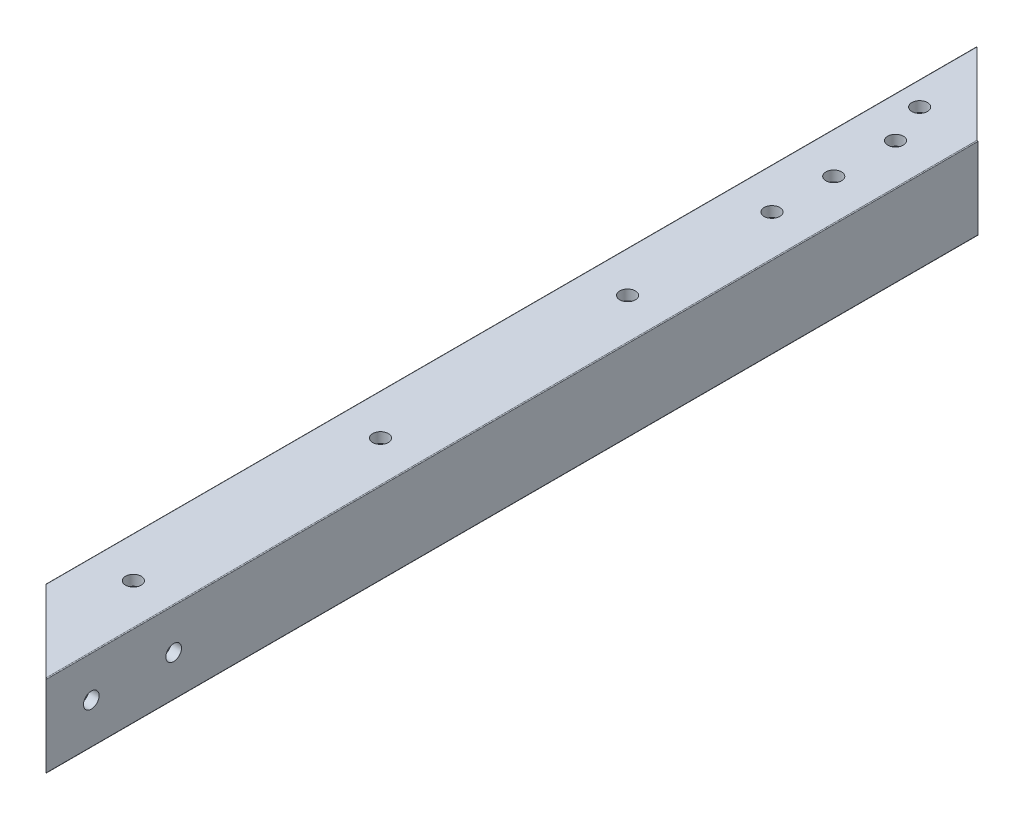
ISO-10303-21;
HEADER;
FILE_DESCRIPTION(('STEP AP214'),'2;1');
FILE_NAME('part.step','',(''),(''),'','','');
FILE_SCHEMA(('AUTOMOTIVE_DESIGN { 1 0 10303 214 1 1 1 1 }'));
ENDSEC;
DATA;
#1=APPLICATION_CONTEXT('core data for automotive mechanical design processes');
#2=APPLICATION_PROTOCOL_DEFINITION('international standard','automotive_design',2000,#1);
#3=PRODUCT_CONTEXT('',#1,'mechanical');
#4=PRODUCT('Part','Part','',(#3));
#5=PRODUCT_RELATED_PRODUCT_CATEGORY('part','',(#4));
#6=PRODUCT_DEFINITION_FORMATION('','',#4);
#7=PRODUCT_DEFINITION_CONTEXT('part definition',#1,'design');
#8=PRODUCT_DEFINITION('design','',#6,#7);
#9=PRODUCT_DEFINITION_SHAPE('','',#8);
#10=(LENGTH_UNIT() NAMED_UNIT(*) SI_UNIT(.MILLI.,.METRE.));
#11=(NAMED_UNIT(*) PLANE_ANGLE_UNIT() SI_UNIT($,.RADIAN.));
#12=(NAMED_UNIT(*) SI_UNIT($,.STERADIAN.) SOLID_ANGLE_UNIT());
#13=UNCERTAINTY_MEASURE_WITH_UNIT(LENGTH_MEASURE(1.E-05),#10,'distance_accuracy_value','');
#14=(GEOMETRIC_REPRESENTATION_CONTEXT(3) GLOBAL_UNCERTAINTY_ASSIGNED_CONTEXT((#13)) GLOBAL_UNIT_ASSIGNED_CONTEXT((#10,
#11,#12)) REPRESENTATION_CONTEXT('',''));
#15=CARTESIAN_POINT('',(0.,0.,0.));
#16=DIRECTION('',(0.,0.,1.));
#17=DIRECTION('',(1.,0.,0.));
#18=AXIS2_PLACEMENT_3D('',#15,#16,#17);
#19=CARTESIAN_POINT('',(3.175,4.7625,1828.8));
#20=DIRECTION('',(1.,0.,0.));
#21=DIRECTION('',(0.,1.,0.));
#22=AXIS2_PLACEMENT_3D('',#19,#20,#21);
#23=PLANE('',#22);
#24=DIRECTION('',(0.,1.,0.));
#25=VECTOR('',#24,1.);
#26=CARTESIAN_POINT('',(3.175,4.7625,1806.575));
#27=LINE('',#26,#25);
#28=CARTESIAN_POINT('',(3.175,4.7625,1806.575));
#29=VERTEX_POINT('',#28);
#30=CARTESIAN_POINT('',(3.175,20.6375,1806.575));
#31=VERTEX_POINT('',#30);
#32=EDGE_CURVE('E319',#29,#31,#27,.T.);
#33=ORIENTED_EDGE('',*,*,#32,.F.);
#34=DIRECTION('',(0.,0.,-1.));
#35=VECTOR('',#34,1.);
#36=CARTESIAN_POINT('',(3.175,4.7625,1828.8));
#37=LINE('',#36,#35);
#38=CARTESIAN_POINT('',(3.175,4.7625,1519.555));
#39=VERTEX_POINT('',#38);
#40=EDGE_CURVE('E67',#29,#39,#37,.T.);
#41=ORIENTED_EDGE('',*,*,#40,.T.);
#42=DIRECTION('',(0.,-1.,0.));
#43=VECTOR('',#42,1.);
#44=CARTESIAN_POINT('',(3.175,4.7625,1519.555));
#45=LINE('',#44,#43);
#46=CARTESIAN_POINT('',(3.175,20.6375,1519.555));
#47=VERTEX_POINT('',#46);
#48=EDGE_CURVE('E265',#47,#39,#45,.T.);
#49=ORIENTED_EDGE('',*,*,#48,.F.);
#50=DIRECTION('',(0.,0.,-1.));
#51=VECTOR('',#50,1.);
#52=CARTESIAN_POINT('',(3.175,20.6375,1828.8));
#53=LINE('',#52,#51);
#54=EDGE_CURVE('E52',#31,#47,#53,.T.);
#55=ORIENTED_EDGE('',*,*,#54,.F.);
#56=EDGE_LOOP('',(#33,#41,#49,#55));
#57=FACE_BOUND('',#56,.T.);
#58=ADVANCED_FACE('F44',(#57),#23,.T.);
#59=CARTESIAN_POINT('',(4.7625,20.6375,1828.8));
#60=DIRECTION('',(0.,0.,-1.));
#61=DIRECTION('',(-1.,0.,0.));
#62=AXIS2_PLACEMENT_3D('',#59,#60,#61);
#63=CYLINDRICAL_SURFACE('',#62,1.5875);
#64=DIRECTION('',(0.,0.,-1.));
#65=VECTOR('',#64,1.);
#66=CARTESIAN_POINT('',(4.7625,22.225,1828.8));
#67=LINE('',#66,#65);
#68=CARTESIAN_POINT('',(4.7625,22.225,1808.1625));
#69=VERTEX_POINT('',#68);
#70=CARTESIAN_POINT('',(4.7625,22.225,1521.1425));
#71=VERTEX_POINT('',#70);
#72=EDGE_CURVE('E222',#69,#71,#67,.T.);
#73=ORIENTED_EDGE('',*,*,#72,.F.);
#74=CARTESIAN_POINT('',(4.7625,20.6375,1808.1625));
#75=DIRECTION('',(0.707106781186545,0.,-0.70710678118655));
#76=DIRECTION('',(-0.70710678118655,0.,-0.707106781186545));
#77=AXIS2_PLACEMENT_3D('',#74,#75,#76);
#78=ELLIPSE('',#77,2.24506403026728,1.5875);
#79=EDGE_CURVE('E312',#69,#31,#78,.F.);
#80=ORIENTED_EDGE('',*,*,#79,.T.);
#81=ORIENTED_EDGE('',*,*,#54,.T.);
#82=CARTESIAN_POINT('',(4.7625,20.6375,1521.1425));
#83=DIRECTION('',(-0.707106781186544,0.,0.707106781186551));
#84=DIRECTION('',(-0.707106781186551,0.,-0.707106781186544));
#85=AXIS2_PLACEMENT_3D('',#82,#83,#84);
#86=ELLIPSE('',#85,2.24506403026728,1.5875);
#87=EDGE_CURVE('E258',#47,#71,#86,.F.);
#88=ORIENTED_EDGE('',*,*,#87,.T.);
#89=EDGE_LOOP('',(#73,#80,#81,#88));
#90=FACE_BOUND('',#89,.T.);
#91=ADVANCED_FACE('F263',(#90),#63,.F.);
#92=CARTESIAN_POINT('',(4.7625,22.225,1828.8));
#93=DIRECTION('',(0.,-1.,0.));
#94=DIRECTION('',(0.,0.,-1.));
#95=AXIS2_PLACEMENT_3D('',#92,#93,#94);
#96=PLANE('',#95);
#97=CARTESIAN_POINT('',(7.43948775786736,22.225,1541.43180412579));
#98=DIRECTION('',(0.,-1.,0.));
#99=DIRECTION('',(0.,0.,-1.));
#100=AXIS2_PLACEMENT_3D('',#97,#98,#99);
#101=CIRCLE('',#100,2.41299999999992);
#102=CARTESIAN_POINT('',(7.43948775786736,22.225,1539.01880412579));
#103=VERTEX_POINT('',#102);
#104=EDGE_CURVE('E512',#103,#103,#101,.T.);
#105=ORIENTED_EDGE('',*,*,#104,.F.);
#106=EDGE_LOOP('',(#105));
#107=FACE_BOUND('',#106,.T.);
#108=CARTESIAN_POINT('',(12.7000000000056,22.225,1554.13180412579));
#109=DIRECTION('',(0.,-1.,0.));
#110=DIRECTION('',(0.,0.,-1.));
#111=AXIS2_PLACEMENT_3D('',#108,#109,#110);
#112=CIRCLE('',#111,2.41300000000005);
#113=CARTESIAN_POINT('',(12.7000000000056,22.225,1551.71880412579));
#114=VERTEX_POINT('',#113);
#115=EDGE_CURVE('E506',#114,#114,#112,.T.);
#116=ORIENTED_EDGE('',*,*,#115,.F.);
#117=EDGE_LOOP('',(#116));
#118=FACE_BOUND('',#117,.T.);
#119=CARTESIAN_POINT('',(12.7000000000055,22.225,1573.18180412579));
#120=DIRECTION('',(0.,-1.,0.));
#121=DIRECTION('',(0.,0.,-1.));
#122=AXIS2_PLACEMENT_3D('',#119,#120,#121);
#123=CIRCLE('',#122,2.413);
#124=CARTESIAN_POINT('',(12.7000000000055,22.225,1570.76880412579));
#125=VERTEX_POINT('',#124);
#126=EDGE_CURVE('E500',#125,#125,#123,.T.);
#127=ORIENTED_EDGE('',*,*,#126,.F.);
#128=EDGE_LOOP('',(#127));
#129=FACE_BOUND('',#128,.T.);
#130=CARTESIAN_POINT('',(12.7000000000054,22.225,1592.23180412579));
#131=DIRECTION('',(0.,-1.,0.));
#132=DIRECTION('',(0.,0.,-1.));
#133=AXIS2_PLACEMENT_3D('',#130,#131,#132);
#134=CIRCLE('',#133,2.41300000000008);
#135=CARTESIAN_POINT('',(12.7000000000054,22.225,1589.81880412579));
#136=VERTEX_POINT('',#135);
#137=EDGE_CURVE('E494',#136,#136,#134,.T.);
#138=ORIENTED_EDGE('',*,*,#137,.F.);
#139=EDGE_LOOP('',(#138));
#140=FACE_BOUND('',#139,.T.);
#141=CARTESIAN_POINT('',(12.7,22.225,1789.15923163679));
#142=DIRECTION('',(0.,-1.,0.));
#143=DIRECTION('',(0.,0.,-1.));
#144=AXIS2_PLACEMENT_3D('',#141,#142,#143);
#145=CIRCLE('',#144,2.413);
#146=CARTESIAN_POINT('',(12.7,22.225,1786.74623163679));
#147=VERTEX_POINT('',#146);
#148=EDGE_CURVE('E548',#147,#147,#145,.T.);
#149=ORIENTED_EDGE('',*,*,#148,.F.);
#150=EDGE_LOOP('',(#149));
#151=FACE_BOUND('',#150,.T.);
#152=CARTESIAN_POINT('',(12.7,22.225,1712.95923163679));
#153=DIRECTION('',(0.,-1.,0.));
#154=DIRECTION('',(0.,0.,-1.));
#155=AXIS2_PLACEMENT_3D('',#152,#153,#154);
#156=CIRCLE('',#155,2.413);
#157=CARTESIAN_POINT('',(12.7,22.225,1710.54623163679));
#158=VERTEX_POINT('',#157);
#159=EDGE_CURVE('E542',#158,#158,#156,.T.);
#160=ORIENTED_EDGE('',*,*,#159,.F.);
#161=EDGE_LOOP('',(#160));
#162=FACE_BOUND('',#161,.T.);
#163=CARTESIAN_POINT('',(12.7,22.225,1636.75923163679));
#164=DIRECTION('',(0.,-1.,0.));
#165=DIRECTION('',(0.,0.,-1.));
#166=AXIS2_PLACEMENT_3D('',#163,#164,#165);
#167=CIRCLE('',#166,2.413);
#168=CARTESIAN_POINT('',(12.7,22.225,1634.34623163679));
#169=VERTEX_POINT('',#168);
#170=EDGE_CURVE('E536',#169,#169,#167,.T.);
#171=ORIENTED_EDGE('',*,*,#170,.F.);
#172=EDGE_LOOP('',(#171));
#173=FACE_BOUND('',#172,.T.);
#174=DIRECTION('',(0.70710678118655,0.,0.707106781186545));
#175=VECTOR('',#174,1.);
#176=CARTESIAN_POINT('',(15.08125,22.225,1818.48125));
#177=LINE('',#176,#175);
#178=CARTESIAN_POINT('',(20.6375,22.225,1824.0375));
#179=VERTEX_POINT('',#178);
#180=EDGE_CURVE('E249',#69,#179,#177,.T.);
#181=ORIENTED_EDGE('',*,*,#180,.F.);
#182=ORIENTED_EDGE('',*,*,#72,.T.);
#183=DIRECTION('',(-0.707106781186551,0.,-0.707106781186544));
#184=VECTOR('',#183,1.);
#185=CARTESIAN_POINT('',(158.59125,22.225,1674.97125));
#186=LINE('',#185,#184);
#187=CARTESIAN_POINT('',(20.6375,22.225,1537.0175));
#188=VERTEX_POINT('',#187);
#189=EDGE_CURVE('E248',#188,#71,#186,.T.);
#190=ORIENTED_EDGE('',*,*,#189,.F.);
#191=DIRECTION('',(0.,0.,-1.));
#192=VECTOR('',#191,1.);
#193=CARTESIAN_POINT('',(20.6375,22.225,1828.8));
#194=LINE('',#193,#192);
#195=EDGE_CURVE('E239',#179,#188,#194,.T.);
#196=ORIENTED_EDGE('',*,*,#195,.F.);
#197=EDGE_LOOP('',(#181,#182,#190,#196));
#198=FACE_BOUND('',#197,.T.);
#199=ADVANCED_FACE('F246',(#107,#118,#129,#140,#151,#162,#173,#198),#96,.T.);
#200=CARTESIAN_POINT('',(20.6375,20.6375,1828.8));
#201=DIRECTION('',(0.,0.,-1.));
#202=DIRECTION('',(-1.,0.,0.));
#203=AXIS2_PLACEMENT_3D('',#200,#201,#202);
#204=CYLINDRICAL_SURFACE('',#203,1.5875);
#205=DIRECTION('',(0.,0.,-1.));
#206=VECTOR('',#205,1.);
#207=CARTESIAN_POINT('',(22.225,20.6375,1828.8));
#208=LINE('',#207,#206);
#209=CARTESIAN_POINT('',(22.225,20.6375,1825.625));
#210=VERTEX_POINT('',#209);
#211=CARTESIAN_POINT('',(22.225,20.6375,1538.605));
#212=VERTEX_POINT('',#211);
#213=EDGE_CURVE('E197',#210,#212,#208,.T.);
#214=ORIENTED_EDGE('',*,*,#213,.F.);
#215=CARTESIAN_POINT('',(20.6375,20.6375,1824.0375));
#216=DIRECTION('',(0.707106781186545,0.,-0.70710678118655));
#217=DIRECTION('',(-0.70710678118655,0.,-0.707106781186545));
#218=AXIS2_PLACEMENT_3D('',#215,#216,#217);
#219=ELLIPSE('',#218,2.24506403026728,1.5875);
#220=EDGE_CURVE('E308',#210,#179,#219,.F.);
#221=ORIENTED_EDGE('',*,*,#220,.T.);
#222=ORIENTED_EDGE('',*,*,#195,.T.);
#223=CARTESIAN_POINT('',(20.6375,20.6375,1537.0175));
#224=DIRECTION('',(-0.707106781186544,0.,0.707106781186551));
#225=DIRECTION('',(-0.707106781186551,0.,-0.707106781186544));
#226=AXIS2_PLACEMENT_3D('',#223,#224,#225);
#227=ELLIPSE('',#226,2.24506403026728,1.5875);
#228=EDGE_CURVE('E261',#188,#212,#227,.F.);
#229=ORIENTED_EDGE('',*,*,#228,.T.);
#230=EDGE_LOOP('',(#214,#221,#222,#229));
#231=FACE_BOUND('',#230,.T.);
#232=ADVANCED_FACE('F306',(#231),#204,.F.);
#233=CARTESIAN_POINT('',(22.225,4.7625,1828.8));
#234=DIRECTION('',(-1.,0.,0.));
#235=DIRECTION('',(0.,0.,1.));
#236=AXIS2_PLACEMENT_3D('',#233,#234,#235);
#237=PLANE('',#236);
#238=CARTESIAN_POINT('',(22.225,12.7,1814.83));
#239=DIRECTION('',(-1.,0.,0.));
#240=DIRECTION('',(0.,0.,1.));
#241=AXIS2_PLACEMENT_3D('',#238,#239,#240);
#242=CIRCLE('',#241,2.4130000000001);
#243=CARTESIAN_POINT('',(22.225,12.7,1817.243));
#244=VERTEX_POINT('',#243);
#245=EDGE_CURVE('E454',#244,#244,#242,.F.);
#246=ORIENTED_EDGE('',*,*,#245,.T.);
#247=EDGE_LOOP('',(#246));
#248=FACE_BOUND('',#247,.T.);
#249=CARTESIAN_POINT('',(22.225,12.7,1789.43));
#250=DIRECTION('',(-1.,0.,0.));
#251=DIRECTION('',(0.,0.,1.));
#252=AXIS2_PLACEMENT_3D('',#249,#250,#251);
#253=CIRCLE('',#252,2.4130000000001);
#254=CARTESIAN_POINT('',(22.225,12.7,1791.843));
#255=VERTEX_POINT('',#254);
#256=EDGE_CURVE('E466',#255,#255,#253,.F.);
#257=ORIENTED_EDGE('',*,*,#256,.T.);
#258=EDGE_LOOP('',(#257));
#259=FACE_BOUND('',#258,.T.);
#260=DIRECTION('',(0.,-1.,0.));
#261=VECTOR('',#260,1.);
#262=CARTESIAN_POINT('',(22.225,4.7625,1825.625));
#263=LINE('',#262,#261);
#264=CARTESIAN_POINT('',(22.225,4.7625,1825.625));
#265=VERTEX_POINT('',#264);
#266=EDGE_CURVE('E310',#210,#265,#263,.T.);
#267=ORIENTED_EDGE('',*,*,#266,.F.);
#268=ORIENTED_EDGE('',*,*,#213,.T.);
#269=DIRECTION('',(0.,1.,0.));
#270=VECTOR('',#269,1.);
#271=CARTESIAN_POINT('',(22.225,4.7625,1538.605));
#272=LINE('',#271,#270);
#273=CARTESIAN_POINT('',(22.225,4.7625,1538.605));
#274=VERTEX_POINT('',#273);
#275=EDGE_CURVE('E303',#274,#212,#272,.T.);
#276=ORIENTED_EDGE('',*,*,#275,.F.);
#277=DIRECTION('',(0.,0.,-1.));
#278=VECTOR('',#277,1.);
#279=CARTESIAN_POINT('',(22.225,4.7625,1828.8));
#280=LINE('',#279,#278);
#281=EDGE_CURVE('E206',#265,#274,#280,.T.);
#282=ORIENTED_EDGE('',*,*,#281,.F.);
#283=EDGE_LOOP('',(#267,#268,#276,#282));
#284=FACE_BOUND('',#283,.T.);
#285=ADVANCED_FACE('F354',(#248,#259,#284),#237,.T.);
#286=CARTESIAN_POINT('',(20.6375,4.7625,1828.8));
#287=DIRECTION('',(0.,0.,-1.));
#288=DIRECTION('',(-1.,0.,0.));
#289=AXIS2_PLACEMENT_3D('',#286,#287,#288);
#290=CYLINDRICAL_SURFACE('',#289,1.5875);
#291=DIRECTION('',(0.,0.,-1.));
#292=VECTOR('',#291,1.);
#293=CARTESIAN_POINT('',(20.6375,3.175,1828.8));
#294=LINE('',#293,#292);
#295=CARTESIAN_POINT('',(20.6375,3.175,1824.0375));
#296=VERTEX_POINT('',#295);
#297=CARTESIAN_POINT('',(20.6375,3.175,1537.0175));
#298=VERTEX_POINT('',#297);
#299=EDGE_CURVE('E205',#296,#298,#294,.T.);
#300=ORIENTED_EDGE('',*,*,#299,.F.);
#301=CARTESIAN_POINT('',(20.6375,4.7625,1824.0375));
#302=DIRECTION('',(0.707106781186545,0.,-0.70710678118655));
#303=DIRECTION('',(-0.70710678118655,0.,-0.707106781186545));
#304=AXIS2_PLACEMENT_3D('',#301,#302,#303);
#305=ELLIPSE('',#304,2.24506403026728,1.5875);
#306=EDGE_CURVE('E314',#296,#265,#305,.F.);
#307=ORIENTED_EDGE('',*,*,#306,.T.);
#308=ORIENTED_EDGE('',*,*,#281,.T.);
#309=CARTESIAN_POINT('',(20.6375,4.7625,1537.0175));
#310=DIRECTION('',(-0.707106781186544,0.,0.707106781186551));
#311=DIRECTION('',(-0.707106781186551,0.,-0.707106781186544));
#312=AXIS2_PLACEMENT_3D('',#309,#310,#311);
#313=ELLIPSE('',#312,2.24506403026728,1.5875);
#314=EDGE_CURVE('E300',#274,#298,#313,.F.);
#315=ORIENTED_EDGE('',*,*,#314,.T.);
#316=EDGE_LOOP('',(#300,#307,#308,#315));
#317=FACE_BOUND('',#316,.T.);
#318=ADVANCED_FACE('F350',(#317),#290,.F.);
#319=CARTESIAN_POINT('',(4.7625,3.175,1828.8));
#320=DIRECTION('',(0.,1.,0.));
#321=DIRECTION('',(1.,0.,0.));
#322=AXIS2_PLACEMENT_3D('',#319,#320,#321);
#323=PLANE('',#322);
#324=CARTESIAN_POINT('',(7.43948775786736,3.175,1541.43180412579));
#325=DIRECTION('',(0.,1.,0.));
#326=DIRECTION('',(0.,0.,1.));
#327=AXIS2_PLACEMENT_3D('',#324,#325,#326);
#328=CIRCLE('',#327,2.41299999999992);
#329=CARTESIAN_POINT('',(7.43948775786736,3.175,1543.84480412579));
#330=VERTEX_POINT('',#329);
#331=EDGE_CURVE('E509',#330,#330,#328,.T.);
#332=ORIENTED_EDGE('',*,*,#331,.F.);
#333=EDGE_LOOP('',(#332));
#334=FACE_BOUND('',#333,.T.);
#335=CARTESIAN_POINT('',(12.7000000000056,3.175,1554.13180412579));
#336=DIRECTION('',(0.,1.,0.));
#337=DIRECTION('',(0.,0.,1.));
#338=AXIS2_PLACEMENT_3D('',#335,#336,#337);
#339=CIRCLE('',#338,2.41300000000005);
#340=CARTESIAN_POINT('',(12.7000000000056,3.175,1556.54480412579));
#341=VERTEX_POINT('',#340);
#342=EDGE_CURVE('E503',#341,#341,#339,.T.);
#343=ORIENTED_EDGE('',*,*,#342,.F.);
#344=EDGE_LOOP('',(#343));
#345=FACE_BOUND('',#344,.T.);
#346=CARTESIAN_POINT('',(12.7000000000055,3.175,1573.18180412579));
#347=DIRECTION('',(0.,1.,0.));
#348=DIRECTION('',(0.,0.,1.));
#349=AXIS2_PLACEMENT_3D('',#346,#347,#348);
#350=CIRCLE('',#349,2.413);
#351=CARTESIAN_POINT('',(12.7000000000055,3.175,1575.59480412579));
#352=VERTEX_POINT('',#351);
#353=EDGE_CURVE('E497',#352,#352,#350,.T.);
#354=ORIENTED_EDGE('',*,*,#353,.F.);
#355=EDGE_LOOP('',(#354));
#356=FACE_BOUND('',#355,.T.);
#357=CARTESIAN_POINT('',(12.7000000000054,3.175,1592.23180412579));
#358=DIRECTION('',(0.,1.,0.));
#359=DIRECTION('',(0.,0.,1.));
#360=AXIS2_PLACEMENT_3D('',#357,#358,#359);
#361=CIRCLE('',#360,2.41300000000008);
#362=CARTESIAN_POINT('',(12.7000000000054,3.175,1594.64480412579));
#363=VERTEX_POINT('',#362);
#364=EDGE_CURVE('E474',#363,#363,#361,.T.);
#365=ORIENTED_EDGE('',*,*,#364,.F.);
#366=EDGE_LOOP('',(#365));
#367=FACE_BOUND('',#366,.T.);
#368=CARTESIAN_POINT('',(12.7,3.175,1789.15923163679));
#369=DIRECTION('',(0.,1.,0.));
#370=DIRECTION('',(0.,0.,1.));
#371=AXIS2_PLACEMENT_3D('',#368,#369,#370);
#372=CIRCLE('',#371,2.413);
#373=CARTESIAN_POINT('',(12.7,3.175,1791.57223163679));
#374=VERTEX_POINT('',#373);
#375=EDGE_CURVE('E545',#374,#374,#372,.T.);
#376=ORIENTED_EDGE('',*,*,#375,.F.);
#377=EDGE_LOOP('',(#376));
#378=FACE_BOUND('',#377,.T.);
#379=CARTESIAN_POINT('',(12.7,3.175,1712.95923163679));
#380=DIRECTION('',(0.,1.,0.));
#381=DIRECTION('',(0.,0.,1.));
#382=AXIS2_PLACEMENT_3D('',#379,#380,#381);
#383=CIRCLE('',#382,2.413);
#384=CARTESIAN_POINT('',(12.7,3.175,1715.37223163679));
#385=VERTEX_POINT('',#384);
#386=EDGE_CURVE('E539',#385,#385,#383,.T.);
#387=ORIENTED_EDGE('',*,*,#386,.F.);
#388=EDGE_LOOP('',(#387));
#389=FACE_BOUND('',#388,.T.);
#390=CARTESIAN_POINT('',(12.7,3.175,1636.75923163679));
#391=DIRECTION('',(0.,1.,0.));
#392=DIRECTION('',(0.,0.,1.));
#393=AXIS2_PLACEMENT_3D('',#390,#391,#392);
#394=CIRCLE('',#393,2.413);
#395=CARTESIAN_POINT('',(12.7,3.175,1639.17223163679));
#396=VERTEX_POINT('',#395);
#397=EDGE_CURVE('E519',#396,#396,#394,.T.);
#398=ORIENTED_EDGE('',*,*,#397,.F.);
#399=EDGE_LOOP('',(#398));
#400=FACE_BOUND('',#399,.T.);
#401=DIRECTION('',(-0.70710678118655,0.,-0.707106781186545));
#402=VECTOR('',#401,1.);
#403=CARTESIAN_POINT('',(15.08125,3.175,1818.48125));
#404=LINE('',#403,#402);
#405=CARTESIAN_POINT('',(4.7625,3.175,1808.1625));
#406=VERTEX_POINT('',#405);
#407=EDGE_CURVE('E59',#296,#406,#404,.T.);
#408=ORIENTED_EDGE('',*,*,#407,.F.);
#409=ORIENTED_EDGE('',*,*,#299,.T.);
#410=DIRECTION('',(0.707106781186551,0.,0.707106781186544));
#411=VECTOR('',#410,1.);
#412=CARTESIAN_POINT('',(158.59125,3.175,1674.97125));
#413=LINE('',#412,#411);
#414=CARTESIAN_POINT('',(4.7625,3.175,1521.1425));
#415=VERTEX_POINT('',#414);
#416=EDGE_CURVE('E298',#415,#298,#413,.T.);
#417=ORIENTED_EDGE('',*,*,#416,.F.);
#418=DIRECTION('',(0.,0.,-1.));
#419=VECTOR('',#418,1.);
#420=CARTESIAN_POINT('',(4.7625,3.175,1828.8));
#421=LINE('',#420,#419);
#422=EDGE_CURVE('E207',#406,#415,#421,.T.);
#423=ORIENTED_EDGE('',*,*,#422,.F.);
#424=EDGE_LOOP('',(#408,#409,#417,#423));
#425=FACE_BOUND('',#424,.T.);
#426=ADVANCED_FACE('F355',(#334,#345,#356,#367,#378,#389,#400,#425),#323,.T.);
#427=CARTESIAN_POINT('',(4.7625,4.7625,1828.8));
#428=DIRECTION('',(0.,0.,-1.));
#429=DIRECTION('',(-1.,0.,0.));
#430=AXIS2_PLACEMENT_3D('',#427,#428,#429);
#431=CYLINDRICAL_SURFACE('',#430,1.5875);
#432=ORIENTED_EDGE('',*,*,#40,.F.);
#433=CARTESIAN_POINT('',(4.7625,4.7625,1808.1625));
#434=DIRECTION('',(0.707106781186545,0.,-0.70710678118655));
#435=DIRECTION('',(-0.70710678118655,0.,-0.707106781186545));
#436=AXIS2_PLACEMENT_3D('',#433,#434,#435);
#437=ELLIPSE('',#436,2.24506403026728,1.5875);
#438=EDGE_CURVE('E345',#29,#406,#437,.F.);
#439=ORIENTED_EDGE('',*,*,#438,.T.);
#440=ORIENTED_EDGE('',*,*,#422,.T.);
#441=CARTESIAN_POINT('',(4.7625,4.7625,1521.1425));
#442=DIRECTION('',(-0.707106781186544,0.,0.707106781186551));
#443=DIRECTION('',(-0.707106781186551,0.,-0.707106781186544));
#444=AXIS2_PLACEMENT_3D('',#441,#442,#443);
#445=ELLIPSE('',#444,2.24506403026728,1.5875);
#446=EDGE_CURVE('E296',#415,#39,#445,.F.);
#447=ORIENTED_EDGE('',*,*,#446,.T.);
#448=EDGE_LOOP('',(#432,#439,#440,#447));
#449=FACE_BOUND('',#448,.T.);
#450=ADVANCED_FACE('F357',(#449),#431,.F.);
#451=CARTESIAN_POINT('',(0.,0.254,1828.8));
#452=DIRECTION('',(1.,0.,0.));
#453=DIRECTION('',(0.,1.,0.));
#454=AXIS2_PLACEMENT_3D('',#451,#452,#453);
#455=PLANE('',#454);
#456=DIRECTION('',(0.,0.,-1.));
#457=VECTOR('',#456,1.);
#458=CARTESIAN_POINT('',(0.,0.254,1828.8));
#459=LINE('',#458,#457);
#460=CARTESIAN_POINT('',(0.,0.254,1803.4));
#461=VERTEX_POINT('',#460);
#462=CARTESIAN_POINT('',(0.,0.254,1516.38));
#463=VERTEX_POINT('',#462);
#464=EDGE_CURVE('E189',#461,#463,#459,.T.);
#465=ORIENTED_EDGE('',*,*,#464,.F.);
#466=DIRECTION('',(0.,1.,0.));
#467=VECTOR('',#466,1.);
#468=CARTESIAN_POINT('',(0.,0.254,1803.4));
#469=LINE('',#468,#467);
#470=CARTESIAN_POINT('',(0.,25.146,1803.4));
#471=VERTEX_POINT('',#470);
#472=EDGE_CURVE('E170',#461,#471,#469,.T.);
#473=ORIENTED_EDGE('',*,*,#472,.T.);
#474=DIRECTION('',(0.,0.,-1.));
#475=VECTOR('',#474,1.);
#476=CARTESIAN_POINT('',(0.,25.146,1828.8));
#477=LINE('',#476,#475);
#478=CARTESIAN_POINT('',(0.,25.1460000000001,1516.38));
#479=VERTEX_POINT('',#478);
#480=EDGE_CURVE('E204',#471,#479,#477,.T.);
#481=ORIENTED_EDGE('',*,*,#480,.T.);
#482=DIRECTION('',(0.,-1.,0.));
#483=VECTOR('',#482,1.);
#484=CARTESIAN_POINT('',(0.,0.254,1516.38));
#485=LINE('',#484,#483);
#486=EDGE_CURVE('E194',#479,#463,#485,.T.);
#487=ORIENTED_EDGE('',*,*,#486,.T.);
#488=EDGE_LOOP('',(#465,#473,#481,#487));
#489=FACE_BOUND('',#488,.T.);
#490=ADVANCED_FACE('F276',(#489),#455,.F.);
#491=CARTESIAN_POINT('',(0.254,25.146,1828.8));
#492=DIRECTION('',(0.,0.,-1.));
#493=DIRECTION('',(-1.,0.,0.));
#494=AXIS2_PLACEMENT_3D('',#491,#492,#493);
#495=CYLINDRICAL_SURFACE('',#494,0.254);
#496=CARTESIAN_POINT('',(0.254,25.146,1803.654));
#497=DIRECTION('',(0.707106781186545,0.,-0.70710678118655));
#498=DIRECTION('',(-0.70710678118655,0.,-0.707106781186545));
#499=AXIS2_PLACEMENT_3D('',#496,#497,#498);
#500=ELLIPSE('',#499,0.359210244842765,0.254);
#501=CARTESIAN_POINT('',(0.253999999999983,25.4,1803.654));
#502=VERTEX_POINT('',#501);
#503=EDGE_CURVE('E342',#502,#471,#500,.F.);
#504=ORIENTED_EDGE('',*,*,#503,.F.);
#505=DIRECTION('',(0.,0.,-1.));
#506=VECTOR('',#505,1.);
#507=CARTESIAN_POINT('',(0.254,25.4,1828.8));
#508=LINE('',#507,#506);
#509=CARTESIAN_POINT('',(0.25399999999999,25.4,1516.634));
#510=VERTEX_POINT('',#509);
#511=EDGE_CURVE('E201',#502,#510,#508,.T.);
#512=ORIENTED_EDGE('',*,*,#511,.T.);
#513=CARTESIAN_POINT('',(0.254,25.146,1516.634));
#514=DIRECTION('',(-0.707106781186544,0.,0.707106781186551));
#515=DIRECTION('',(-0.707106781186551,0.,-0.707106781186544));
#516=AXIS2_PLACEMENT_3D('',#513,#514,#515);
#517=ELLIPSE('',#516,0.359210244842764,0.254);
#518=EDGE_CURVE('E281',#479,#510,#517,.F.);
#519=ORIENTED_EDGE('',*,*,#518,.F.);
#520=ORIENTED_EDGE('',*,*,#480,.F.);
#521=EDGE_LOOP('',(#504,#512,#519,#520));
#522=FACE_BOUND('',#521,.T.);
#523=ADVANCED_FACE('F285',(#522),#495,.T.);
#524=CARTESIAN_POINT('',(0.254,25.4,1828.8));
#525=DIRECTION('',(0.,-1.,0.));
#526=DIRECTION('',(0.,0.,-1.));
#527=AXIS2_PLACEMENT_3D('',#524,#525,#526);
#528=PLANE('',#527);
#529=CARTESIAN_POINT('',(7.43948775786736,25.4,1541.43180412579));
#530=DIRECTION('',(0.,-1.,0.));
#531=DIRECTION('',(0.,0.,-1.));
#532=AXIS2_PLACEMENT_3D('',#529,#530,#531);
#533=CIRCLE('',#532,2.41299999999992);
#534=CARTESIAN_POINT('',(7.43948775786736,25.4,1539.01880412579));
#535=VERTEX_POINT('',#534);
#536=EDGE_CURVE('E471',#535,#535,#533,.T.);
#537=ORIENTED_EDGE('',*,*,#536,.T.);
#538=EDGE_LOOP('',(#537));
#539=FACE_BOUND('',#538,.T.);
#540=CARTESIAN_POINT('',(12.7000000000056,25.4,1554.13180412579));
#541=DIRECTION('',(0.,-1.,0.));
#542=DIRECTION('',(0.,0.,-1.));
#543=AXIS2_PLACEMENT_3D('',#540,#541,#542);
#544=CIRCLE('',#543,2.41300000000005);
#545=CARTESIAN_POINT('',(12.7000000000056,25.4,1551.71880412579));
#546=VERTEX_POINT('',#545);
#547=EDGE_CURVE('E478',#546,#546,#544,.T.);
#548=ORIENTED_EDGE('',*,*,#547,.T.);
#549=EDGE_LOOP('',(#548));
#550=FACE_BOUND('',#549,.T.);
#551=CARTESIAN_POINT('',(12.7000000000055,25.4,1573.18180412579));
#552=DIRECTION('',(0.,-1.,0.));
#553=DIRECTION('',(0.,0.,-1.));
#554=AXIS2_PLACEMENT_3D('',#551,#552,#553);
#555=CIRCLE('',#554,2.413);
#556=CARTESIAN_POINT('',(12.7000000000055,25.4,1570.76880412579));
#557=VERTEX_POINT('',#556);
#558=EDGE_CURVE('E484',#557,#557,#555,.T.);
#559=ORIENTED_EDGE('',*,*,#558,.T.);
#560=EDGE_LOOP('',(#559));
#561=FACE_BOUND('',#560,.T.);
#562=CARTESIAN_POINT('',(12.7000000000054,25.4,1592.23180412579));
#563=DIRECTION('',(0.,-1.,0.));
#564=DIRECTION('',(0.,0.,-1.));
#565=AXIS2_PLACEMENT_3D('',#562,#563,#564);
#566=CIRCLE('',#565,2.41300000000008);
#567=CARTESIAN_POINT('',(12.7000000000054,25.4,1589.81880412579));
#568=VERTEX_POINT('',#567);
#569=EDGE_CURVE('E461',#568,#568,#566,.T.);
#570=ORIENTED_EDGE('',*,*,#569,.T.);
#571=EDGE_LOOP('',(#570));
#572=FACE_BOUND('',#571,.T.);
#573=CARTESIAN_POINT('',(12.7,25.4,1789.15923163679));
#574=DIRECTION('',(0.,1.,0.));
#575=DIRECTION('',(0.,0.,1.));
#576=AXIS2_PLACEMENT_3D('',#573,#574,#575);
#577=CIRCLE('',#576,2.413);
#578=CARTESIAN_POINT('',(12.7,25.4,1791.57223163679));
#579=VERTEX_POINT('',#578);
#580=EDGE_CURVE('E520',#579,#579,#577,.T.);
#581=ORIENTED_EDGE('',*,*,#580,.F.);
#582=EDGE_LOOP('',(#581));
#583=FACE_BOUND('',#582,.T.);
#584=CARTESIAN_POINT('',(12.7,25.4,1712.95923163679));
#585=DIRECTION('',(0.,1.,0.));
#586=DIRECTION('',(0.,0.,1.));
#587=AXIS2_PLACEMENT_3D('',#584,#585,#586);
#588=CIRCLE('',#587,2.413);
#589=CARTESIAN_POINT('',(12.7,25.4,1715.37223163679));
#590=VERTEX_POINT('',#589);
#591=EDGE_CURVE('E526',#590,#590,#588,.T.);
#592=ORIENTED_EDGE('',*,*,#591,.F.);
#593=EDGE_LOOP('',(#592));
#594=FACE_BOUND('',#593,.T.);
#595=CARTESIAN_POINT('',(12.7,25.4,1636.75923163679));
#596=DIRECTION('',(0.,1.,0.));
#597=DIRECTION('',(0.,0.,1.));
#598=AXIS2_PLACEMENT_3D('',#595,#596,#597);
#599=CIRCLE('',#598,2.413);
#600=CARTESIAN_POINT('',(12.7,25.4,1639.17223163679));
#601=VERTEX_POINT('',#600);
#602=EDGE_CURVE('E515',#601,#601,#599,.T.);
#603=ORIENTED_EDGE('',*,*,#602,.F.);
#604=EDGE_LOOP('',(#603));
#605=FACE_BOUND('',#604,.T.);
#606=ORIENTED_EDGE('',*,*,#511,.F.);
#607=DIRECTION('',(-0.70710678118655,0.,-0.707106781186545));
#608=VECTOR('',#607,1.);
#609=CARTESIAN_POINT('',(34.1927663058368,25.4,1837.59276630584));
#610=LINE('',#609,#608);
#611=CARTESIAN_POINT('',(25.146,25.4,1828.546));
#612=VERTEX_POINT('',#611);
#613=EDGE_CURVE('E183',#612,#502,#610,.T.);
#614=ORIENTED_EDGE('',*,*,#613,.F.);
#615=DIRECTION('',(0.,0.,-1.));
#616=VECTOR('',#615,1.);
#617=CARTESIAN_POINT('',(25.146,25.4,1828.8));
#618=LINE('',#617,#616);
#619=CARTESIAN_POINT('',(25.146,25.4,1541.526));
#620=VERTEX_POINT('',#619);
#621=EDGE_CURVE('E199',#612,#620,#618,.T.);
#622=ORIENTED_EDGE('',*,*,#621,.T.);
#623=DIRECTION('',(0.707106781186551,0.,0.707106781186544));
#624=VECTOR('',#623,1.);
#625=CARTESIAN_POINT('',(25.2088679499494,25.4,1541.58886794995));
#626=LINE('',#625,#624);
#627=EDGE_CURVE('E321',#510,#620,#626,.T.);
#628=ORIENTED_EDGE('',*,*,#627,.F.);
#629=EDGE_LOOP('',(#606,#614,#622,#628));
#630=FACE_BOUND('',#629,.T.);
#631=ADVANCED_FACE('F391',(#539,#550,#561,#572,#583,#594,#605,#630),#528,.F.);
#632=CARTESIAN_POINT('',(25.146,25.146,1828.8));
#633=DIRECTION('',(0.,0.,-1.));
#634=DIRECTION('',(-1.,0.,0.));
#635=AXIS2_PLACEMENT_3D('',#632,#633,#634);
#636=CYLINDRICAL_SURFACE('',#635,0.254);
#637=CARTESIAN_POINT('',(25.146,25.146,1828.546));
#638=DIRECTION('',(0.707106781186545,0.,-0.70710678118655));
#639=DIRECTION('',(-0.70710678118655,0.,-0.707106781186545));
#640=AXIS2_PLACEMENT_3D('',#637,#638,#639);
#641=ELLIPSE('',#640,0.359210244842765,0.254);
#642=CARTESIAN_POINT('',(25.4000000000002,25.146,1828.8));
#643=VERTEX_POINT('',#642);
#644=EDGE_CURVE('E335',#643,#612,#641,.F.);
#645=ORIENTED_EDGE('',*,*,#644,.F.);
#646=DIRECTION('',(0.,0.,-1.));
#647=VECTOR('',#646,1.);
#648=CARTESIAN_POINT('',(25.4,25.146,1828.8));
#649=LINE('',#648,#647);
#650=CARTESIAN_POINT('',(25.4,25.146,1541.3977358999));
#651=VERTEX_POINT('',#650);
#652=EDGE_CURVE('E202',#643,#651,#649,.T.);
#653=ORIENTED_EDGE('',*,*,#652,.T.);
#654=CARTESIAN_POINT('',(25.146,25.146,1541.6517358999));
#655=DIRECTION('',(0.707106781186552,0.,0.707106781186543));
#656=DIRECTION('',(0.707106781186543,0.,-0.707106781186552));
#657=AXIS2_PLACEMENT_3D('',#654,#655,#656);
#658=ELLIPSE('',#657,0.359210244842768,0.254);
#659=CARTESIAN_POINT('',(25.2088679499494,25.3920967713506,1541.58886794995));
#660=VERTEX_POINT('',#659);
#661=EDGE_CURVE('E272',#660,#651,#658,.F.);
#662=ORIENTED_EDGE('',*,*,#661,.F.);
#663=CARTESIAN_POINT('',(25.146,25.146,1541.526));
#664=DIRECTION('',(-0.707106781186544,0.,0.707106781186551));
#665=DIRECTION('',(-0.707106781186551,0.,-0.707106781186544));
#666=AXIS2_PLACEMENT_3D('',#663,#664,#665);
#667=ELLIPSE('',#666,0.359210244842764,0.254);
#668=EDGE_CURVE('E289',#620,#660,#667,.F.);
#669=ORIENTED_EDGE('',*,*,#668,.F.);
#670=ORIENTED_EDGE('',*,*,#621,.F.);
#671=EDGE_LOOP('',(#645,#653,#662,#669,#670));
#672=FACE_BOUND('',#671,.T.);
#673=ADVANCED_FACE('F46',(#672),#636,.T.);
#674=CARTESIAN_POINT('',(25.4,0.254,1828.8));
#675=DIRECTION('',(-1.,0.,0.));
#676=DIRECTION('',(0.,0.,1.));
#677=AXIS2_PLACEMENT_3D('',#674,#675,#676);
#678=PLANE('',#677);
#679=CARTESIAN_POINT('',(25.4,12.7,1814.83));
#680=DIRECTION('',(1.,0.,0.));
#681=DIRECTION('',(0.,0.,-1.));
#682=AXIS2_PLACEMENT_3D('',#679,#680,#681);
#683=CIRCLE('',#682,2.4130000000001);
#684=CARTESIAN_POINT('',(25.4,12.7,1812.417));
#685=VERTEX_POINT('',#684);
#686=EDGE_CURVE('E457',#685,#685,#683,.T.);
#687=ORIENTED_EDGE('',*,*,#686,.F.);
#688=EDGE_LOOP('',(#687));
#689=FACE_BOUND('',#688,.T.);
#690=CARTESIAN_POINT('',(25.4,12.7,1789.43));
#691=DIRECTION('',(1.,0.,0.));
#692=DIRECTION('',(0.,0.,-1.));
#693=AXIS2_PLACEMENT_3D('',#690,#691,#692);
#694=CIRCLE('',#693,2.4130000000001);
#695=CARTESIAN_POINT('',(25.4,12.7,1787.017));
#696=VERTEX_POINT('',#695);
#697=EDGE_CURVE('E463',#696,#696,#694,.T.);
#698=ORIENTED_EDGE('',*,*,#697,.F.);
#699=EDGE_LOOP('',(#698));
#700=FACE_BOUND('',#699,.T.);
#701=DIRECTION('',(0.,0.,-1.));
#702=VECTOR('',#701,1.);
#703=CARTESIAN_POINT('',(25.4,0.254,1828.8));
#704=LINE('',#703,#702);
#705=CARTESIAN_POINT('',(25.4,0.254,1828.8));
#706=VERTEX_POINT('',#705);
#707=CARTESIAN_POINT('',(25.4,0.254,1541.3977358999));
#708=VERTEX_POINT('',#707);
#709=EDGE_CURVE('E223',#706,#708,#704,.T.);
#710=ORIENTED_EDGE('',*,*,#709,.T.);
#711=DIRECTION('',(0.,1.,0.));
#712=VECTOR('',#711,1.);
#713=CARTESIAN_POINT('',(25.4,0.254,1541.3977358999));
#714=LINE('',#713,#712);
#715=EDGE_CURVE('E267',#708,#651,#714,.T.);
#716=ORIENTED_EDGE('',*,*,#715,.T.);
#717=ORIENTED_EDGE('',*,*,#652,.F.);
#718=DIRECTION('',(0.,1.,0.));
#719=VECTOR('',#718,1.);
#720=CARTESIAN_POINT('',(25.4,0.254,1828.8));
#721=LINE('',#720,#719);
#722=EDGE_CURVE('E190',#706,#643,#721,.T.);
#723=ORIENTED_EDGE('',*,*,#722,.F.);
#724=EDGE_LOOP('',(#710,#716,#717,#723));
#725=FACE_BOUND('',#724,.T.);
#726=ADVANCED_FACE('F336',(#689,#700,#725),#678,.F.);
#727=CARTESIAN_POINT('',(25.146,0.254,1828.8));
#728=DIRECTION('',(0.,0.,-1.));
#729=DIRECTION('',(-1.,0.,0.));
#730=AXIS2_PLACEMENT_3D('',#727,#728,#729);
#731=CYLINDRICAL_SURFACE('',#730,0.254);
#732=CARTESIAN_POINT('',(25.146,0.254,1828.546));
#733=DIRECTION('',(0.707106781186545,0.,-0.70710678118655));
#734=DIRECTION('',(-0.70710678118655,0.,-0.707106781186545));
#735=AXIS2_PLACEMENT_3D('',#732,#733,#734);
#736=ELLIPSE('',#735,0.359210244842765,0.254);
#737=CARTESIAN_POINT('',(25.146,0.,1828.546));
#738=VERTEX_POINT('',#737);
#739=EDGE_CURVE('E174',#738,#706,#736,.F.);
#740=ORIENTED_EDGE('',*,*,#739,.F.);
#741=DIRECTION('',(0.,0.,-1.));
#742=VECTOR('',#741,1.);
#743=CARTESIAN_POINT('',(25.146,0.,1828.8));
#744=LINE('',#743,#742);
#745=CARTESIAN_POINT('',(25.1460000000001,0.,1541.526));
#746=VERTEX_POINT('',#745);
#747=EDGE_CURVE('E182',#738,#746,#744,.T.);
#748=ORIENTED_EDGE('',*,*,#747,.T.);
#749=CARTESIAN_POINT('',(25.146,0.254,1541.526));
#750=DIRECTION('',(-0.707106781186544,0.,0.707106781186551));
#751=DIRECTION('',(-0.707106781186551,0.,-0.707106781186544));
#752=AXIS2_PLACEMENT_3D('',#749,#750,#751);
#753=ELLIPSE('',#752,0.359210244842764,0.254);
#754=CARTESIAN_POINT('',(25.2088679499494,0.00790322864945014,1541.58886794995));
#755=VERTEX_POINT('',#754);
#756=EDGE_CURVE('E287',#755,#746,#753,.F.);
#757=ORIENTED_EDGE('',*,*,#756,.F.);
#758=CARTESIAN_POINT('',(25.146,0.254,1541.6517358999));
#759=DIRECTION('',(0.707106781186552,0.,0.707106781186543));
#760=DIRECTION('',(0.707106781186543,0.,-0.707106781186552));
#761=AXIS2_PLACEMENT_3D('',#758,#759,#760);
#762=ELLIPSE('',#761,0.359210244842768,0.254);
#763=EDGE_CURVE('E11',#708,#755,#762,.F.);
#764=ORIENTED_EDGE('',*,*,#763,.F.);
#765=ORIENTED_EDGE('',*,*,#709,.F.);
#766=EDGE_LOOP('',(#740,#748,#757,#764,#765));
#767=FACE_BOUND('',#766,.T.);
#768=ADVANCED_FACE('F337',(#767),#731,.T.);
#769=CARTESIAN_POINT('',(0.254,0.,1828.8));
#770=DIRECTION('',(0.,1.,0.));
#771=DIRECTION('',(1.,0.,0.));
#772=AXIS2_PLACEMENT_3D('',#769,#770,#771);
#773=PLANE('',#772);
#774=CARTESIAN_POINT('',(7.43948775786736,0.,1541.43180412579));
#775=DIRECTION('',(0.,-1.,0.));
#776=DIRECTION('',(0.,0.,-1.));
#777=AXIS2_PLACEMENT_3D('',#774,#775,#776);
#778=CIRCLE('',#777,2.41299999999992);
#779=CARTESIAN_POINT('',(7.43948775786736,0.,1539.01880412579));
#780=VERTEX_POINT('',#779);
#781=EDGE_CURVE('E475',#780,#780,#778,.T.);
#782=ORIENTED_EDGE('',*,*,#781,.F.);
#783=EDGE_LOOP('',(#782));
#784=FACE_BOUND('',#783,.T.);
#785=CARTESIAN_POINT('',(12.7000000000056,0.,1554.13180412579));
#786=DIRECTION('',(0.,-1.,0.));
#787=DIRECTION('',(0.,0.,-1.));
#788=AXIS2_PLACEMENT_3D('',#785,#786,#787);
#789=CIRCLE('',#788,2.41300000000005);
#790=CARTESIAN_POINT('',(12.7000000000056,0.,1551.71880412579));
#791=VERTEX_POINT('',#790);
#792=EDGE_CURVE('E481',#791,#791,#789,.T.);
#793=ORIENTED_EDGE('',*,*,#792,.F.);
#794=EDGE_LOOP('',(#793));
#795=FACE_BOUND('',#794,.T.);
#796=CARTESIAN_POINT('',(12.7000000000055,0.,1573.18180412579));
#797=DIRECTION('',(0.,-1.,0.));
#798=DIRECTION('',(0.,0.,-1.));
#799=AXIS2_PLACEMENT_3D('',#796,#797,#798);
#800=CIRCLE('',#799,2.413);
#801=CARTESIAN_POINT('',(12.7000000000055,0.,1570.76880412579));
#802=VERTEX_POINT('',#801);
#803=EDGE_CURVE('E487',#802,#802,#800,.T.);
#804=ORIENTED_EDGE('',*,*,#803,.F.);
#805=EDGE_LOOP('',(#804));
#806=FACE_BOUND('',#805,.T.);
#807=CARTESIAN_POINT('',(12.7000000000054,0.,1592.23180412579));
#808=DIRECTION('',(0.,-1.,0.));
#809=DIRECTION('',(0.,0.,-1.));
#810=AXIS2_PLACEMENT_3D('',#807,#808,#809);
#811=CIRCLE('',#810,2.41300000000008);
#812=CARTESIAN_POINT('',(12.7000000000054,0.,1589.81880412579));
#813=VERTEX_POINT('',#812);
#814=EDGE_CURVE('E458',#813,#813,#811,.T.);
#815=ORIENTED_EDGE('',*,*,#814,.F.);
#816=EDGE_LOOP('',(#815));
#817=FACE_BOUND('',#816,.T.);
#818=CARTESIAN_POINT('',(12.7,0.,1789.15923163679));
#819=DIRECTION('',(0.,1.,0.));
#820=DIRECTION('',(0.,0.,1.));
#821=AXIS2_PLACEMENT_3D('',#818,#819,#820);
#822=CIRCLE('',#821,2.413);
#823=CARTESIAN_POINT('',(12.7,0.,1791.57223163679));
#824=VERTEX_POINT('',#823);
#825=EDGE_CURVE('E516',#824,#824,#822,.T.);
#826=ORIENTED_EDGE('',*,*,#825,.T.);
#827=EDGE_LOOP('',(#826));
#828=FACE_BOUND('',#827,.T.);
#829=CARTESIAN_POINT('',(12.7,0.,1712.95923163679));
#830=DIRECTION('',(0.,1.,0.));
#831=DIRECTION('',(0.,0.,1.));
#832=AXIS2_PLACEMENT_3D('',#829,#830,#831);
#833=CIRCLE('',#832,2.413);
#834=CARTESIAN_POINT('',(12.7,0.,1715.37223163679));
#835=VERTEX_POINT('',#834);
#836=EDGE_CURVE('E523',#835,#835,#833,.T.);
#837=ORIENTED_EDGE('',*,*,#836,.T.);
#838=EDGE_LOOP('',(#837));
#839=FACE_BOUND('',#838,.T.);
#840=CARTESIAN_POINT('',(12.7,0.,1636.75923163679));
#841=DIRECTION('',(0.,1.,0.));
#842=DIRECTION('',(0.,0.,1.));
#843=AXIS2_PLACEMENT_3D('',#840,#841,#842);
#844=CIRCLE('',#843,2.413);
#845=CARTESIAN_POINT('',(12.7,0.,1639.17223163679));
#846=VERTEX_POINT('',#845);
#847=EDGE_CURVE('E529',#846,#846,#844,.T.);
#848=ORIENTED_EDGE('',*,*,#847,.T.);
#849=EDGE_LOOP('',(#848));
#850=FACE_BOUND('',#849,.T.);
#851=ORIENTED_EDGE('',*,*,#747,.F.);
#852=DIRECTION('',(0.70710678118655,0.,0.707106781186545));
#853=VECTOR('',#852,1.);
#854=CARTESIAN_POINT('',(34.1927663058368,0.,1837.59276630584));
#855=LINE('',#854,#853);
#856=CARTESIAN_POINT('',(0.253999999999999,0.,1803.654));
#857=VERTEX_POINT('',#856);
#858=EDGE_CURVE('E167',#857,#738,#855,.T.);
#859=ORIENTED_EDGE('',*,*,#858,.F.);
#860=DIRECTION('',(0.,0.,-1.));
#861=VECTOR('',#860,1.);
#862=CARTESIAN_POINT('',(0.254,0.,1828.8));
#863=LINE('',#862,#861);
#864=CARTESIAN_POINT('',(0.253999999999995,0.,1516.634));
#865=VERTEX_POINT('',#864);
#866=EDGE_CURVE('E180',#857,#865,#863,.T.);
#867=ORIENTED_EDGE('',*,*,#866,.T.);
#868=DIRECTION('',(-0.707106781186551,0.,-0.707106781186544));
#869=VECTOR('',#868,1.);
#870=CARTESIAN_POINT('',(25.2088679499494,0.,1541.58886794995));
#871=LINE('',#870,#869);
#872=EDGE_CURVE('E291',#746,#865,#871,.T.);
#873=ORIENTED_EDGE('',*,*,#872,.F.);
#874=EDGE_LOOP('',(#851,#859,#867,#873));
#875=FACE_BOUND('',#874,.T.);
#876=ADVANCED_FACE('F178',(#784,#795,#806,#817,#828,#839,#850,#875),#773,.F.);
#877=CARTESIAN_POINT('',(0.254,0.254,1828.8));
#878=DIRECTION('',(0.,0.,-1.));
#879=DIRECTION('',(-1.,0.,0.));
#880=AXIS2_PLACEMENT_3D('',#877,#878,#879);
#881=CYLINDRICAL_SURFACE('',#880,0.254);
#882=CARTESIAN_POINT('',(0.254,0.254,1803.654));
#883=DIRECTION('',(0.707106781186545,0.,-0.70710678118655));
#884=DIRECTION('',(-0.70710678118655,0.,-0.707106781186545));
#885=AXIS2_PLACEMENT_3D('',#882,#883,#884);
#886=ELLIPSE('',#885,0.359210244842765,0.254);
#887=EDGE_CURVE('E164',#461,#857,#886,.F.);
#888=ORIENTED_EDGE('',*,*,#887,.F.);
#889=ORIENTED_EDGE('',*,*,#464,.T.);
#890=CARTESIAN_POINT('',(0.254,0.254,1516.634));
#891=DIRECTION('',(-0.707106781186544,0.,0.707106781186551));
#892=DIRECTION('',(-0.707106781186551,0.,-0.707106781186544));
#893=AXIS2_PLACEMENT_3D('',#890,#891,#892);
#894=ELLIPSE('',#893,0.359210244842764,0.254);
#895=EDGE_CURVE('E188',#865,#463,#894,.F.);
#896=ORIENTED_EDGE('',*,*,#895,.F.);
#897=ORIENTED_EDGE('',*,*,#866,.F.);
#898=EDGE_LOOP('',(#888,#889,#896,#897));
#899=FACE_BOUND('',#898,.T.);
#900=ADVANCED_FACE('F186',(#899),#881,.T.);
#901=CARTESIAN_POINT('',(43.1693801920876,-76.2000000000001,1523.62835570781));
#902=DIRECTION('',(0.707106781186552,0.,0.707106781186543));
#903=DIRECTION('',(0.707106781186543,0.,-0.707106781186552));
#904=AXIS2_PLACEMENT_3D('',#901,#902,#903);
#905=PLANE('',#904);
#906=ORIENTED_EDGE('',*,*,#661,.T.);
#907=ORIENTED_EDGE('',*,*,#715,.F.);
#908=ORIENTED_EDGE('',*,*,#763,.T.);
#909=DIRECTION('',(0.,1.,0.));
#910=VECTOR('',#909,1.);
#911=CARTESIAN_POINT('',(25.2088679499494,-76.2000000000001,1541.58886794995));
#912=LINE('',#911,#910);
#913=EDGE_CURVE('E323',#755,#660,#912,.T.);
#914=ORIENTED_EDGE('',*,*,#913,.T.);
#915=EDGE_LOOP('',(#906,#907,#908,#914));
#916=FACE_BOUND('',#915,.T.);
#917=ADVANCED_FACE('F328',(#916),#905,.F.);
#918=CARTESIAN_POINT('',(25.2088679499494,-76.2000000000001,1541.58886794995));
#919=DIRECTION('',(-0.707106781186544,0.,0.707106781186551));
#920=DIRECTION('',(0.707106781186551,0.,0.707106781186544));
#921=AXIS2_PLACEMENT_3D('',#918,#919,#920);
#922=PLANE('',#921);
#923=ORIENTED_EDGE('',*,*,#48,.T.);
#924=ORIENTED_EDGE('',*,*,#446,.F.);
#925=ORIENTED_EDGE('',*,*,#416,.T.);
#926=ORIENTED_EDGE('',*,*,#314,.F.);
#927=ORIENTED_EDGE('',*,*,#275,.T.);
#928=ORIENTED_EDGE('',*,*,#228,.F.);
#929=ORIENTED_EDGE('',*,*,#189,.T.);
#930=ORIENTED_EDGE('',*,*,#87,.F.);
#931=EDGE_LOOP('',(#923,#924,#925,#926,#927,#928,#929,#930));
#932=FACE_BOUND('',#931,.T.);
#933=ORIENTED_EDGE('',*,*,#668,.T.);
#934=ORIENTED_EDGE('',*,*,#913,.F.);
#935=ORIENTED_EDGE('',*,*,#756,.T.);
#936=ORIENTED_EDGE('',*,*,#872,.T.);
#937=ORIENTED_EDGE('',*,*,#895,.T.);
#938=ORIENTED_EDGE('',*,*,#486,.F.);
#939=ORIENTED_EDGE('',*,*,#518,.T.);
#940=ORIENTED_EDGE('',*,*,#627,.T.);
#941=EDGE_LOOP('',(#933,#934,#935,#936,#937,#938,#939,#940));
#942=FACE_BOUND('',#941,.T.);
#943=ADVANCED_FACE('F256',(#932,#942),#922,.F.);
#944=CARTESIAN_POINT('',(34.1927663058368,-76.1999999999998,1837.59276630584));
#945=DIRECTION('',(0.707106781186545,0.,-0.70710678118655));
#946=DIRECTION('',(-0.70710678118655,0.,-0.707106781186545));
#947=AXIS2_PLACEMENT_3D('',#944,#945,#946);
#948=PLANE('',#947);
#949=ORIENTED_EDGE('',*,*,#32,.T.);
#950=ORIENTED_EDGE('',*,*,#79,.F.);
#951=ORIENTED_EDGE('',*,*,#180,.T.);
#952=ORIENTED_EDGE('',*,*,#220,.F.);
#953=ORIENTED_EDGE('',*,*,#266,.T.);
#954=ORIENTED_EDGE('',*,*,#306,.F.);
#955=ORIENTED_EDGE('',*,*,#407,.T.);
#956=ORIENTED_EDGE('',*,*,#438,.F.);
#957=EDGE_LOOP('',(#949,#950,#951,#952,#953,#954,#955,#956));
#958=FACE_BOUND('',#957,.T.);
#959=ORIENTED_EDGE('',*,*,#644,.T.);
#960=ORIENTED_EDGE('',*,*,#613,.T.);
#961=ORIENTED_EDGE('',*,*,#503,.T.);
#962=ORIENTED_EDGE('',*,*,#472,.F.);
#963=ORIENTED_EDGE('',*,*,#887,.T.);
#964=ORIENTED_EDGE('',*,*,#858,.T.);
#965=ORIENTED_EDGE('',*,*,#739,.T.);
#966=ORIENTED_EDGE('',*,*,#722,.T.);
#967=EDGE_LOOP('',(#959,#960,#961,#962,#963,#964,#965,#966));
#968=FACE_BOUND('',#967,.T.);
#969=ADVANCED_FACE('F166',(#958,#968),#948,.F.);
#970=CARTESIAN_POINT('',(12.7,0.,1636.75923163679));
#971=DIRECTION('',(0.,1.,0.));
#972=DIRECTION('',(0.,0.,1.));
#973=AXIS2_PLACEMENT_3D('',#970,#971,#972);
#974=CYLINDRICAL_SURFACE('',#973,2.413);
#975=ORIENTED_EDGE('',*,*,#397,.T.);
#976=EDGE_LOOP('',(#975));
#977=FACE_BOUND('',#976,.T.);
#978=ORIENTED_EDGE('',*,*,#847,.F.);
#979=EDGE_LOOP('',(#978));
#980=FACE_BOUND('',#979,.T.);
#981=ADVANCED_FACE('F407',(#977,#980),#974,.F.);
#982=CARTESIAN_POINT('',(12.7,0.,1712.95923163679));
#983=DIRECTION('',(0.,1.,0.));
#984=DIRECTION('',(0.,0.,1.));
#985=AXIS2_PLACEMENT_3D('',#982,#983,#984);
#986=CYLINDRICAL_SURFACE('',#985,2.413);
#987=ORIENTED_EDGE('',*,*,#386,.T.);
#988=EDGE_LOOP('',(#987));
#989=FACE_BOUND('',#988,.T.);
#990=ORIENTED_EDGE('',*,*,#836,.F.);
#991=EDGE_LOOP('',(#990));
#992=FACE_BOUND('',#991,.T.);
#993=ADVANCED_FACE('F410',(#989,#992),#986,.F.);
#994=CARTESIAN_POINT('',(12.7,0.,1789.15923163679));
#995=DIRECTION('',(0.,1.,0.));
#996=DIRECTION('',(0.,0.,1.));
#997=AXIS2_PLACEMENT_3D('',#994,#995,#996);
#998=CYLINDRICAL_SURFACE('',#997,2.413);
#999=ORIENTED_EDGE('',*,*,#375,.T.);
#1000=EDGE_LOOP('',(#999));
#1001=FACE_BOUND('',#1000,.T.);
#1002=ORIENTED_EDGE('',*,*,#825,.F.);
#1003=EDGE_LOOP('',(#1002));
#1004=FACE_BOUND('',#1003,.T.);
#1005=ADVANCED_FACE('F415',(#1001,#1004),#998,.F.);
#1006=ORIENTED_EDGE('',*,*,#170,.T.);
#1007=EDGE_LOOP('',(#1006));
#1008=FACE_BOUND('',#1007,.T.);
#1009=ORIENTED_EDGE('',*,*,#602,.T.);
#1010=EDGE_LOOP('',(#1009));
#1011=FACE_BOUND('',#1010,.T.);
#1012=ADVANCED_FACE('F412',(#1008,#1011),#974,.F.);
#1013=ORIENTED_EDGE('',*,*,#159,.T.);
#1014=EDGE_LOOP('',(#1013));
#1015=FACE_BOUND('',#1014,.T.);
#1016=ORIENTED_EDGE('',*,*,#591,.T.);
#1017=EDGE_LOOP('',(#1016));
#1018=FACE_BOUND('',#1017,.T.);
#1019=ADVANCED_FACE('F417',(#1015,#1018),#986,.F.);
#1020=ORIENTED_EDGE('',*,*,#148,.T.);
#1021=EDGE_LOOP('',(#1020));
#1022=FACE_BOUND('',#1021,.T.);
#1023=ORIENTED_EDGE('',*,*,#580,.T.);
#1024=EDGE_LOOP('',(#1023));
#1025=FACE_BOUND('',#1024,.T.);
#1026=ADVANCED_FACE('F421',(#1022,#1025),#998,.F.);
#1027=CARTESIAN_POINT('',(12.7000000000054,25.4,1592.23180412579));
#1028=DIRECTION('',(0.,-1.,0.));
#1029=DIRECTION('',(0.,0.,-1.));
#1030=AXIS2_PLACEMENT_3D('',#1027,#1028,#1029);
#1031=CYLINDRICAL_SURFACE('',#1030,2.41300000000008);
#1032=ORIENTED_EDGE('',*,*,#364,.T.);
#1033=EDGE_LOOP('',(#1032));
#1034=FACE_BOUND('',#1033,.T.);
#1035=ORIENTED_EDGE('',*,*,#814,.T.);
#1036=EDGE_LOOP('',(#1035));
#1037=FACE_BOUND('',#1036,.T.);
#1038=ADVANCED_FACE('F422',(#1034,#1037),#1031,.F.);
#1039=CARTESIAN_POINT('',(12.7000000000055,25.4,1573.18180412579));
#1040=DIRECTION('',(0.,-1.,0.));
#1041=DIRECTION('',(0.,0.,-1.));
#1042=AXIS2_PLACEMENT_3D('',#1039,#1040,#1041);
#1043=CYLINDRICAL_SURFACE('',#1042,2.413);
#1044=ORIENTED_EDGE('',*,*,#353,.T.);
#1045=EDGE_LOOP('',(#1044));
#1046=FACE_BOUND('',#1045,.T.);
#1047=ORIENTED_EDGE('',*,*,#803,.T.);
#1048=EDGE_LOOP('',(#1047));
#1049=FACE_BOUND('',#1048,.T.);
#1050=ADVANCED_FACE('F425',(#1046,#1049),#1043,.F.);
#1051=CARTESIAN_POINT('',(12.7000000000056,25.4,1554.13180412579));
#1052=DIRECTION('',(0.,-1.,0.));
#1053=DIRECTION('',(0.,0.,-1.));
#1054=AXIS2_PLACEMENT_3D('',#1051,#1052,#1053);
#1055=CYLINDRICAL_SURFACE('',#1054,2.41300000000005);
#1056=ORIENTED_EDGE('',*,*,#342,.T.);
#1057=EDGE_LOOP('',(#1056));
#1058=FACE_BOUND('',#1057,.T.);
#1059=ORIENTED_EDGE('',*,*,#792,.T.);
#1060=EDGE_LOOP('',(#1059));
#1061=FACE_BOUND('',#1060,.T.);
#1062=ADVANCED_FACE('F430',(#1058,#1061),#1055,.F.);
#1063=CARTESIAN_POINT('',(7.43948775786736,25.4,1541.43180412579));
#1064=DIRECTION('',(0.,-1.,0.));
#1065=DIRECTION('',(0.,0.,-1.));
#1066=AXIS2_PLACEMENT_3D('',#1063,#1064,#1065);
#1067=CYLINDRICAL_SURFACE('',#1066,2.41299999999992);
#1068=ORIENTED_EDGE('',*,*,#331,.T.);
#1069=EDGE_LOOP('',(#1068));
#1070=FACE_BOUND('',#1069,.T.);
#1071=ORIENTED_EDGE('',*,*,#781,.T.);
#1072=EDGE_LOOP('',(#1071));
#1073=FACE_BOUND('',#1072,.T.);
#1074=ADVANCED_FACE('F435',(#1070,#1073),#1067,.F.);
#1075=ORIENTED_EDGE('',*,*,#137,.T.);
#1076=EDGE_LOOP('',(#1075));
#1077=FACE_BOUND('',#1076,.T.);
#1078=ORIENTED_EDGE('',*,*,#569,.F.);
#1079=EDGE_LOOP('',(#1078));
#1080=FACE_BOUND('',#1079,.T.);
#1081=ADVANCED_FACE('F427',(#1077,#1080),#1031,.F.);
#1082=ORIENTED_EDGE('',*,*,#126,.T.);
#1083=EDGE_LOOP('',(#1082));
#1084=FACE_BOUND('',#1083,.T.);
#1085=ORIENTED_EDGE('',*,*,#558,.F.);
#1086=EDGE_LOOP('',(#1085));
#1087=FACE_BOUND('',#1086,.T.);
#1088=ADVANCED_FACE('F432',(#1084,#1087),#1043,.F.);
#1089=ORIENTED_EDGE('',*,*,#115,.T.);
#1090=EDGE_LOOP('',(#1089));
#1091=FACE_BOUND('',#1090,.T.);
#1092=ORIENTED_EDGE('',*,*,#547,.F.);
#1093=EDGE_LOOP('',(#1092));
#1094=FACE_BOUND('',#1093,.T.);
#1095=ADVANCED_FACE('F437',(#1091,#1094),#1055,.F.);
#1096=ORIENTED_EDGE('',*,*,#104,.T.);
#1097=EDGE_LOOP('',(#1096));
#1098=FACE_BOUND('',#1097,.T.);
#1099=ORIENTED_EDGE('',*,*,#536,.F.);
#1100=EDGE_LOOP('',(#1099));
#1101=FACE_BOUND('',#1100,.T.);
#1102=ADVANCED_FACE('F441',(#1098,#1101),#1067,.F.);
#1103=CARTESIAN_POINT('',(-0.001000000000001,12.7,1789.43));
#1104=DIRECTION('',(1.,0.,0.));
#1105=DIRECTION('',(0.,0.,-1.));
#1106=AXIS2_PLACEMENT_3D('',#1103,#1104,#1105);
#1107=CYLINDRICAL_SURFACE('',#1106,2.4130000000001);
#1108=ORIENTED_EDGE('',*,*,#256,.F.);
#1109=EDGE_LOOP('',(#1108));
#1110=FACE_BOUND('',#1109,.T.);
#1111=ORIENTED_EDGE('',*,*,#697,.T.);
#1112=EDGE_LOOP('',(#1111));
#1113=FACE_BOUND('',#1112,.T.);
#1114=ADVANCED_FACE('F442',(#1110,#1113),#1107,.F.);
#1115=CARTESIAN_POINT('',(-0.001000000000001,12.7,1814.83));
#1116=DIRECTION('',(1.,0.,0.));
#1117=DIRECTION('',(0.,0.,-1.));
#1118=AXIS2_PLACEMENT_3D('',#1115,#1116,#1117);
#1119=CYLINDRICAL_SURFACE('',#1118,2.4130000000001);
#1120=ORIENTED_EDGE('',*,*,#245,.F.);
#1121=EDGE_LOOP('',(#1120));
#1122=FACE_BOUND('',#1121,.T.);
#1123=ORIENTED_EDGE('',*,*,#686,.T.);
#1124=EDGE_LOOP('',(#1123));
#1125=FACE_BOUND('',#1124,.T.);
#1126=ADVANCED_FACE('F445',(#1122,#1125),#1119,.F.);
#1127=CLOSED_SHELL('',(#58,#91,#199,#232,#285,#318,#426,#450,#490,#523,#631,#673,#726,#768,#876,
#900,#917,#943,#969,#981,#993,#1005,#1012,#1019,#1026,#1038,#1050,#1062,#1074,#1081,#1088,#1095,
#1102,#1114,#1126));
#1128=MANIFOLD_SOLID_BREP('B2',#1127);
#1129=ADVANCED_BREP_SHAPE_REPRESENTATION('',(#18,#1128),#14);
#1130=SHAPE_DEFINITION_REPRESENTATION(#9,#1129);
ENDSEC;
END-ISO-10303-21;
